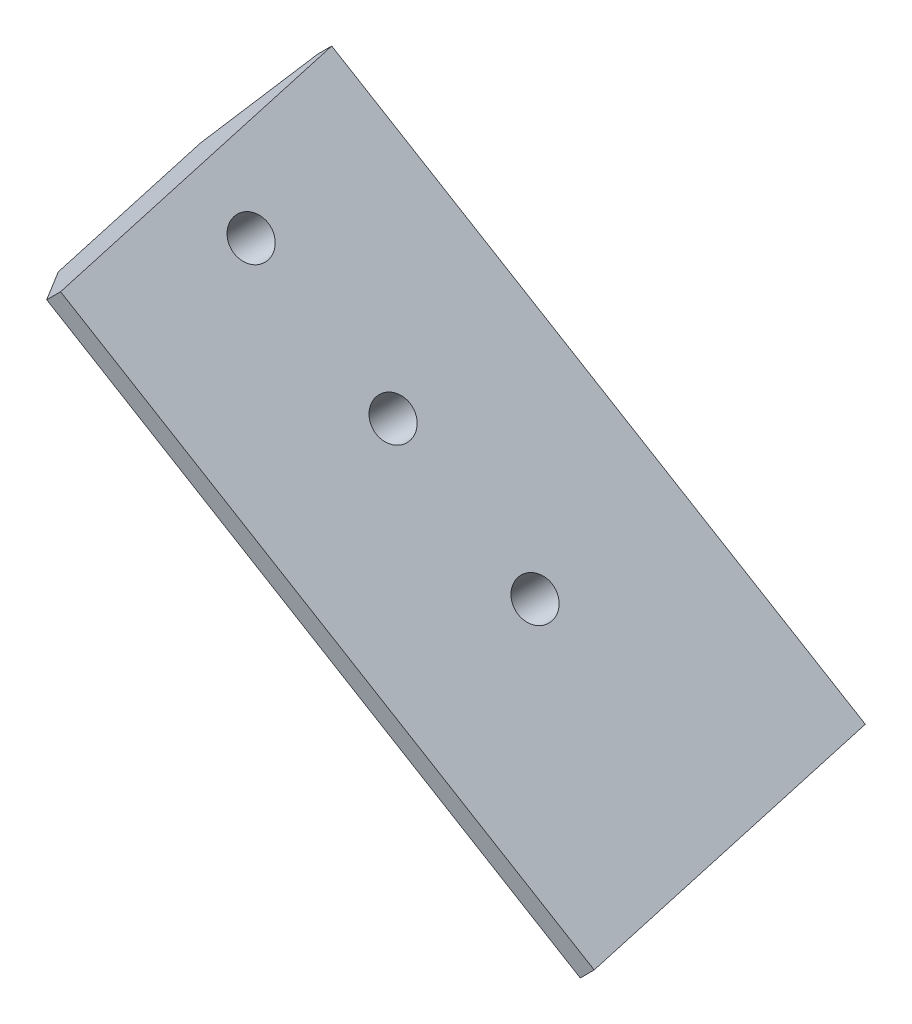
ISO-10303-21;
HEADER;
FILE_DESCRIPTION(('STEP AP214'),'2;1');
FILE_NAME('part.step','',(''),(''),'','','');
FILE_SCHEMA(('AUTOMOTIVE_DESIGN { 1 0 10303 214 1 1 1 1 }'));
ENDSEC;
DATA;
#1=APPLICATION_CONTEXT('core data for automotive mechanical design processes');
#2=APPLICATION_PROTOCOL_DEFINITION('international standard','automotive_design',2000,#1);
#3=PRODUCT_CONTEXT('',#1,'mechanical');
#4=PRODUCT('Part','Part','',(#3));
#5=PRODUCT_RELATED_PRODUCT_CATEGORY('part','',(#4));
#6=PRODUCT_DEFINITION_FORMATION('','',#4);
#7=PRODUCT_DEFINITION_CONTEXT('part definition',#1,'design');
#8=PRODUCT_DEFINITION('design','',#6,#7);
#9=PRODUCT_DEFINITION_SHAPE('','',#8);
#10=(LENGTH_UNIT() NAMED_UNIT(*) SI_UNIT(.MILLI.,.METRE.));
#11=(NAMED_UNIT(*) PLANE_ANGLE_UNIT() SI_UNIT($,.RADIAN.));
#12=(NAMED_UNIT(*) SI_UNIT($,.STERADIAN.) SOLID_ANGLE_UNIT());
#13=UNCERTAINTY_MEASURE_WITH_UNIT(LENGTH_MEASURE(1.E-05),#10,'distance_accuracy_value','');
#14=(GEOMETRIC_REPRESENTATION_CONTEXT(3) GLOBAL_UNCERTAINTY_ASSIGNED_CONTEXT((#13)) GLOBAL_UNIT_ASSIGNED_CONTEXT((#10,
#11,#12)) REPRESENTATION_CONTEXT('',''));
#15=CARTESIAN_POINT('',(0.,0.,0.));
#16=DIRECTION('',(0.,0.,1.));
#17=DIRECTION('',(1.,0.,0.));
#18=AXIS2_PLACEMENT_3D('',#15,#16,#17);
#19=CARTESIAN_POINT('',(2301.17091138971,-454.636764766131,75.5684436134808));
#20=DIRECTION('',(-0.707106781186548,-0.707106781186547,-1.38414541674983E-13));
#21=DIRECTION('',(0.707106781186547,-0.707106781186548,0.));
#22=AXIS2_PLACEMENT_3D('',#19,#20,#21);
#23=CONICAL_SURFACE('',#22,3.45000000012907,0.785398163395434);
#24=CARTESIAN_POINT('',(2301.17091138977,-454.636764766074,75.5684436134808));
#25=DIRECTION('',(-0.707106781186548,-0.707106781186547,-1.38414541674983E-13));
#26=DIRECTION('',(0.707106781186547,-0.707106781186548,0.));
#27=AXIS2_PLACEMENT_3D('',#24,#25,#26);
#28=CIRCLE('',#27,3.45000000004904);
#29=CARTESIAN_POINT('',(2303.6104297849,-457.076283161203,75.5684436134808));
#30=VERTEX_POINT('',#29);
#31=EDGE_CURVE('E122',#30,#30,#28,.F.);
#32=ORIENTED_EDGE('',*,*,#31,.F.);
#33=EDGE_LOOP('',(#32));
#34=FACE_BOUND('',#33,.T.);
#35=CARTESIAN_POINT('',(2301.84266283199,-453.965013323851,75.5684436134809));
#36=DIRECTION('',(-0.707106781186503,-0.707106781186592,0.));
#37=DIRECTION('',(0.707106781186592,-0.707106781186503,0.));
#38=AXIS2_PLACEMENT_3D('',#35,#36,#37);
#39=CIRCLE('',#38,2.5);
#40=CARTESIAN_POINT('',(2303.61042978496,-455.732780276817,75.5684436134809));
#41=VERTEX_POINT('',#40);
#42=EDGE_CURVE('E101',#41,#41,#39,.F.);
#43=ORIENTED_EDGE('',*,*,#42,.T.);
#44=EDGE_LOOP('',(#43));
#45=FACE_BOUND('',#44,.T.);
#46=ADVANCED_FACE('F17',(#34,#45),#23,.F.);
#47=CARTESIAN_POINT('',(2330.07002735808,-483.535880734265,68.36204424156));
#48=DIRECTION('',(-0.707106781186434,-0.707106781186661,0.));
#49=DIRECTION('',(0.707106781186661,-0.707106781186434,0.));
#50=AXIS2_PLACEMENT_3D('',#47,#48,#49);
#51=CONICAL_SURFACE('',#50,3.45000000007031,0.785398163408309);
#52=CARTESIAN_POINT('',(2330.07002735816,-483.535880734184,68.36204424156));
#53=DIRECTION('',(-0.707106781186434,-0.707106781186661,0.));
#54=DIRECTION('',(0.707106781186661,-0.707106781186434,0.));
#55=AXIS2_PLACEMENT_3D('',#52,#53,#54);
#56=CIRCLE('',#55,3.44999999995523);
#57=CARTESIAN_POINT('',(2332.50954575322,-485.975399129245,68.36204424156));
#58=VERTEX_POINT('',#57);
#59=EDGE_CURVE('E20',#58,#58,#56,.F.);
#60=ORIENTED_EDGE('',*,*,#59,.F.);
#61=EDGE_LOOP('',(#60));
#62=FACE_BOUND('',#61,.T.);
#63=CARTESIAN_POINT('',(2330.74177880024,-482.864129292097,68.3620442415602));
#64=DIRECTION('',(-0.707106781186503,-0.707106781186592,0.));
#65=DIRECTION('',(0.707106781186592,-0.707106781186503,0.));
#66=AXIS2_PLACEMENT_3D('',#63,#64,#65);
#67=CIRCLE('',#66,2.5);
#68=CARTESIAN_POINT('',(2332.50954575321,-484.631896245063,68.3620442415602));
#69=VERTEX_POINT('',#68);
#70=EDGE_CURVE('E106',#69,#69,#67,.F.);
#71=ORIENTED_EDGE('',*,*,#70,.T.);
#72=EDGE_LOOP('',(#71));
#73=FACE_BOUND('',#72,.T.);
#74=ADVANCED_FACE('F131',(#62,#73),#51,.F.);
#75=CARTESIAN_POINT('',(2315.62046937664,-469.086322752486,71.965243926872));
#76=DIRECTION('',(-0.707106781186513,-0.707106781186582,0.));
#77=DIRECTION('',(0.707106781186582,-0.707106781186513,0.));
#78=AXIS2_PLACEMENT_3D('',#75,#76,#77);
#79=CONICAL_SURFACE('',#78,3.44999999985659,0.785398163417411);
#80=CARTESIAN_POINT('',(2315.62046937657,-469.086322752556,71.965243926872));
#81=DIRECTION('',(-0.707106781186513,-0.707106781186582,0.));
#82=DIRECTION('',(0.707106781186582,-0.707106781186513,0.));
#83=AXIS2_PLACEMENT_3D('',#80,#81,#82);
#84=CIRCLE('',#83,3.44999999995523);
#85=CARTESIAN_POINT('',(2318.05998777163,-471.525841147618,71.965243926872));
#86=VERTEX_POINT('',#85);
#87=EDGE_CURVE('E103',#86,#86,#84,.F.);
#88=ORIENTED_EDGE('',*,*,#87,.F.);
#89=EDGE_LOOP('',(#88));
#90=FACE_BOUND('',#89,.T.);
#91=CARTESIAN_POINT('',(2316.29222081863,-468.41457131049,71.9652439268721));
#92=DIRECTION('',(-0.707106781186503,-0.707106781186592,0.));
#93=DIRECTION('',(0.707106781186592,-0.707106781186503,0.));
#94=AXIS2_PLACEMENT_3D('',#91,#92,#93);
#95=CIRCLE('',#94,2.5);
#96=CARTESIAN_POINT('',(2318.0599877716,-470.182338263456,71.9652439268721));
#97=VERTEX_POINT('',#96);
#98=EDGE_CURVE('E81',#97,#97,#95,.F.);
#99=ORIENTED_EDGE('',*,*,#98,.T.);
#100=EDGE_LOOP('',(#99));
#101=FACE_BOUND('',#100,.T.);
#102=ADVANCED_FACE('F134',(#90,#101),#79,.F.);
#103=CARTESIAN_POINT('',(2326.32812028619,-466.358944819765,50.6991222747484));
#104=DIRECTION('',(-0.586824088833399,-0.41317591116653,-0.696364240320077));
#105=DIRECTION('',(-0.764688187763723,0.,0.644400477571698));
#106=AXIS2_PLACEMENT_3D('',#103,#104,#105);
#107=PLANE('',#106);
#108=DIRECTION('',(0.696364240320073,-0.696364240319967,-0.173648177666922));
#109=VECTOR('',#108,1.);
#110=CARTESIAN_POINT('',(2294.31524887046,-447.781102246584,66.6534266797069));
#111=LINE('',#110,#109);
#112=CARTESIAN_POINT('',(2294.31524887046,-447.781102246584,66.6534266797069));
#113=VERTEX_POINT('',#112);
#114=CARTESIAN_POINT('',(2348.63165961543,-502.097512991543,53.1088688216854));
#115=VERTEX_POINT('',#114);
#116=EDGE_CURVE('E68',#113,#115,#111,.T.);
#117=ORIENTED_EDGE('',*,*,#116,.F.);
#118=DIRECTION('',(-0.413175911166596,-0.586824088833598,0.69636424031987));
#119=VECTOR('',#118,1.);
#120=CARTESIAN_POINT('',(2299.86627915403,-439.897103687606,57.2977530260918));
#121=LINE('',#120,#119);
#122=CARTESIAN_POINT('',(2299.86627915403,-439.897103687606,57.2977530260917));
#123=VERTEX_POINT('',#122);
#124=EDGE_CURVE('E84',#123,#113,#121,.T.);
#125=ORIENTED_EDGE('',*,*,#124,.F.);
#126=DIRECTION('',(-0.6963642403201,0.696364240319938,0.173648177666931));
#127=VECTOR('',#126,1.);
#128=CARTESIAN_POINT('',(2354.182689899,-494.213514432563,43.7531951680708));
#129=LINE('',#128,#127);
#130=CARTESIAN_POINT('',(2354.182689899,-494.213514432563,43.7531951680701));
#131=VERTEX_POINT('',#130);
#132=EDGE_CURVE('E73',#131,#123,#129,.T.);
#133=ORIENTED_EDGE('',*,*,#132,.F.);
#134=DIRECTION('',(-0.413175911166616,-0.586824088833581,0.696364240319873));
#135=VECTOR('',#134,1.);
#136=CARTESIAN_POINT('',(2354.182689899,-494.213514432563,43.7531951680711));
#137=LINE('',#136,#135);
#138=EDGE_CURVE('E295',#131,#115,#137,.T.);
#139=ORIENTED_EDGE('',*,*,#138,.T.);
#140=EDGE_LOOP('',(#117,#125,#133,#139));
#141=FACE_BOUND('',#140,.T.);
#142=ADVANCED_FACE('F85',(#141),#107,.T.);
#143=CARTESIAN_POINT('',(2323.35563388597,-476.821487262092,80.7357587416199));
#144=DIRECTION('',(-0.707106781186503,-0.707106781186592,0.));
#145=DIRECTION('',(0.707106781186592,-0.707106781186503,0.));
#146=AXIS2_PLACEMENT_3D('',#143,#144,#145);
#147=PLANE('',#146);
#148=ORIENTED_EDGE('',*,*,#116,.T.);
#149=DIRECTION('',(0.122787803968983,-0.122787803968964,0.984807753012208));
#150=VECTOR('',#149,1.);
#151=CARTESIAN_POINT('',(2349.92093155711,-503.386784933217,63.4493502283161));
#152=LINE('',#151,#150);
#153=CARTESIAN_POINT('',(2351.21020349878,-504.676056874893,73.7898316349431));
#154=VERTEX_POINT('',#153);
#155=EDGE_CURVE('E293',#115,#154,#152,.T.);
#156=ORIENTED_EDGE('',*,*,#155,.T.);
#157=DIRECTION('',(0.696364240320092,-0.696364240319951,-0.173648177666907));
#158=VECTOR('',#157,1.);
#159=CARTESIAN_POINT('',(2296.89379275381,-450.359646129935,87.3343894929638));
#160=LINE('',#159,#158);
#161=CARTESIAN_POINT('',(2296.89379275381,-450.359646129935,87.3343894929635));
#162=VERTEX_POINT('',#161);
#163=EDGE_CURVE('E98',#162,#154,#160,.T.);
#164=ORIENTED_EDGE('',*,*,#163,.F.);
#165=DIRECTION('',(0.122787803968983,-0.122787803968964,0.984807753012208));
#166=VECTOR('',#165,1.);
#167=CARTESIAN_POINT('',(2295.60452081214,-449.07037418826,76.9939080863367));
#168=LINE('',#167,#166);
#169=EDGE_CURVE('E88',#113,#162,#168,.T.);
#170=ORIENTED_EDGE('',*,*,#169,.F.);
#171=EDGE_LOOP('',(#148,#156,#164,#170));
#172=FACE_BOUND('',#171,.T.);
#173=ORIENTED_EDGE('',*,*,#87,.T.);
#174=EDGE_LOOP('',(#173));
#175=FACE_BOUND('',#174,.T.);
#176=ORIENTED_EDGE('',*,*,#31,.T.);
#177=EDGE_LOOP('',(#176));
#178=FACE_BOUND('',#177,.T.);
#179=ORIENTED_EDGE('',*,*,#59,.T.);
#180=EDGE_LOOP('',(#179));
#181=FACE_BOUND('',#180,.T.);
#182=ADVANCED_FACE('F129',(#172,#175,#178,#181),#147,.T.);
#183=CARTESIAN_POINT('',(2323.35563388597,-476.821487262092,80.7357587416199));
#184=DIRECTION('',(-0.413175911166535,-0.586824088833529,0.696364240319965));
#185=DIRECTION('',(0.,-0.764688187763602,-0.644400477571842));
#186=AXIS2_PLACEMENT_3D('',#183,#184,#185);
#187=PLANE('',#186);
#188=DIRECTION('',(0.696364240320033,-0.696364240320004,-0.173648177666931));
#189=VECTOR('',#188,1.);
#190=CARTESIAN_POINT('',(2304.77779131279,-444.808615846367,96.6900631465797));
#191=LINE('',#190,#189);
#192=CARTESIAN_POINT('',(2304.77779131279,-444.808615846367,96.6900631465809));
#193=VERTEX_POINT('',#192);
#194=CARTESIAN_POINT('',(2359.09420205775,-499.125026591325,83.1455052885593));
#195=VERTEX_POINT('',#194);
#196=EDGE_CURVE('E306',#193,#195,#191,.T.);
#197=ORIENTED_EDGE('',*,*,#196,.F.);
#198=DIRECTION('',(0.586824088833433,0.413175911166614,0.696364240319999));
#199=VECTOR('',#198,1.);
#200=CARTESIAN_POINT('',(2296.89379275381,-450.359646129934,87.3343894929633));
#201=LINE('',#200,#199);
#202=EDGE_CURVE('E308',#162,#193,#201,.T.);
#203=ORIENTED_EDGE('',*,*,#202,.F.);
#204=ORIENTED_EDGE('',*,*,#163,.T.);
#205=DIRECTION('',(0.586824088833312,0.413175911166412,0.696364240320221));
#206=VECTOR('',#205,1.);
#207=CARTESIAN_POINT('',(2351.21020349878,-504.676056874891,73.7898316349427));
#208=LINE('',#207,#206);
#209=EDGE_CURVE('E296',#154,#195,#208,.T.);
#210=ORIENTED_EDGE('',*,*,#209,.T.);
#211=EDGE_LOOP('',(#197,#203,#204,#210));
#212=FACE_BOUND('',#211,.T.);
#213=ADVANCED_FACE('F150',(#212),#187,.T.);
#214=CARTESIAN_POINT('',(2301.17091138986,-454.636764765981,75.5684436134808));
#215=DIRECTION('',(-0.707106781186503,-0.707106781186592,0.));
#216=DIRECTION('',(0.707106781186592,-0.707106781186503,0.));
#217=AXIS2_PLACEMENT_3D('',#214,#215,#216);
#218=CYLINDRICAL_SURFACE('',#217,2.5);
#219=CARTESIAN_POINT('',(2309.6561927641,-446.151483391741,75.5684436134817));
#220=DIRECTION('',(-0.707106781186503,-0.707106781186592,0.));
#221=DIRECTION('',(0.707106781186592,-0.707106781186503,0.));
#222=AXIS2_PLACEMENT_3D('',#219,#220,#221);
#223=CIRCLE('',#222,2.5);
#224=CARTESIAN_POINT('',(2311.42395971707,-447.919250344707,75.5684436134817));
#225=VERTEX_POINT('',#224);
#226=EDGE_CURVE('E118',#225,#225,#223,.T.);
#227=ORIENTED_EDGE('',*,*,#226,.F.);
#228=EDGE_LOOP('',(#227));
#229=FACE_BOUND('',#228,.T.);
#230=ORIENTED_EDGE('',*,*,#42,.F.);
#231=EDGE_LOOP('',(#230));
#232=FACE_BOUND('',#231,.T.);
#233=ADVANCED_FACE('F140',(#229,#232),#218,.F.);
#234=CARTESIAN_POINT('',(2330.07002735811,-483.535880734226,68.3620442415601));
#235=DIRECTION('',(-0.707106781186503,-0.707106781186592,0.));
#236=DIRECTION('',(0.707106781186592,-0.707106781186503,0.));
#237=AXIS2_PLACEMENT_3D('',#234,#235,#236);
#238=CYLINDRICAL_SURFACE('',#237,2.5);
#239=CARTESIAN_POINT('',(2338.55530873235,-475.050599359986,68.362044241561));
#240=DIRECTION('',(-0.707106781186503,-0.707106781186592,0.));
#241=DIRECTION('',(0.707106781186592,-0.707106781186503,0.));
#242=AXIS2_PLACEMENT_3D('',#239,#240,#241);
#243=CIRCLE('',#242,2.5);
#244=CARTESIAN_POINT('',(2340.32307568532,-476.818366312952,68.362044241561));
#245=VERTEX_POINT('',#244);
#246=EDGE_CURVE('E115',#245,#245,#243,.T.);
#247=ORIENTED_EDGE('',*,*,#246,.F.);
#248=EDGE_LOOP('',(#247));
#249=FACE_BOUND('',#248,.T.);
#250=ORIENTED_EDGE('',*,*,#70,.F.);
#251=EDGE_LOOP('',(#250));
#252=FACE_BOUND('',#251,.T.);
#253=ADVANCED_FACE('F137',(#249,#252),#238,.F.);
#254=CARTESIAN_POINT('',(2315.6204693765,-469.08632275262,71.965243926872));
#255=DIRECTION('',(-0.707106781186503,-0.707106781186592,0.));
#256=DIRECTION('',(0.707106781186592,-0.707106781186503,0.));
#257=AXIS2_PLACEMENT_3D('',#254,#255,#256);
#258=CYLINDRICAL_SURFACE('',#257,2.5);
#259=ORIENTED_EDGE('',*,*,#98,.F.);
#260=EDGE_LOOP('',(#259));
#261=FACE_BOUND('',#260,.T.);
#262=CARTESIAN_POINT('',(2324.10575075074,-460.60104137838,71.9652439268729));
#263=DIRECTION('',(-0.707106781186503,-0.707106781186592,0.));
#264=DIRECTION('',(0.707106781186592,-0.707106781186503,0.));
#265=AXIS2_PLACEMENT_3D('',#262,#263,#264);
#266=CIRCLE('',#265,2.5);
#267=CARTESIAN_POINT('',(2325.87351770371,-462.368808331346,71.9652439268729));
#268=VERTEX_POINT('',#267);
#269=EDGE_CURVE('E111',#268,#268,#266,.T.);
#270=ORIENTED_EDGE('',*,*,#269,.F.);
#271=EDGE_LOOP('',(#270));
#272=FACE_BOUND('',#271,.T.);
#273=ADVANCED_FACE('F139',(#261,#272),#258,.F.);
#274=CARTESIAN_POINT('',(2328.09588723916,-464.591177866798,50.6991222747486));
#275=DIRECTION('',(-0.122787803968928,0.122787803969019,-0.984807753012208));
#276=DIRECTION('',(0.,0.992316665359125,0.12372403020653));
#277=AXIS2_PLACEMENT_3D('',#274,#275,#276);
#278=PLANE('',#277);
#279=ORIENTED_EDGE('',*,*,#132,.T.);
#280=DIRECTION('',(-0.707106781186494,-0.707106781186601,0.));
#281=VECTOR('',#280,1.);
#282=CARTESIAN_POINT('',(2306.5837935753,-433.179589266335,57.2977530260925));
#283=LINE('',#282,#281);
#284=CARTESIAN_POINT('',(2301.634046107,-438.129336734641,57.2977530260919));
#285=VERTEX_POINT('',#284);
#286=EDGE_CURVE('E76',#285,#123,#283,.T.);
#287=ORIENTED_EDGE('',*,*,#286,.F.);
#288=DIRECTION('',(-0.696364240320071,0.696364240319964,0.17364817766694));
#289=VECTOR('',#288,1.);
#290=CARTESIAN_POINT('',(2355.95045685196,-492.445747479596,43.7531951680713));
#291=LINE('',#290,#289);
#292=CARTESIAN_POINT('',(2355.95045685196,-492.445747479598,43.7531951680713));
#293=VERTEX_POINT('',#292);
#294=EDGE_CURVE('E114',#293,#285,#291,.T.);
#295=ORIENTED_EDGE('',*,*,#294,.F.);
#296=DIRECTION('',(-0.707106781186494,-0.707106781186601,0.));
#297=VECTOR('',#296,1.);
#298=CARTESIAN_POINT('',(2360.90020432027,-487.496000011292,43.7531951680707));
#299=LINE('',#298,#297);
#300=EDGE_CURVE('E79',#293,#131,#299,.T.);
#301=ORIENTED_EDGE('',*,*,#300,.T.);
#302=EDGE_LOOP('',(#279,#287,#295,#301));
#303=FACE_BOUND('',#302,.T.);
#304=ADVANCED_FACE('F74',(#303),#278,.T.);
#305=CARTESIAN_POINT('',(2309.03954965468,-435.635345345714,76.9939080863367));
#306=DIRECTION('',(-0.696364240320072,0.696364240319966,0.173648177666931));
#307=DIRECTION('',(-0.707106781186494,-0.707106781186601,0.));
#308=AXIS2_PLACEMENT_3D('',#305,#306,#307);
#309=PLANE('',#308);
#310=ORIENTED_EDGE('',*,*,#202,.T.);
#311=DIRECTION('',(-0.70710678118506,-0.707106781188035,-4.38538094727734E-13));
#312=VECTOR('',#311,1.);
#313=CARTESIAN_POINT('',(2306.54555826575,-443.0408488934,96.6900631465808));
#314=LINE('',#313,#312);
#315=CARTESIAN_POINT('',(2306.54555826575,-443.0408488934,96.6900631465805));
#316=VERTEX_POINT('',#315);
#317=EDGE_CURVE('E303',#316,#193,#314,.T.);
#318=ORIENTED_EDGE('',*,*,#317,.F.);
#319=DIRECTION('',(0.12278780396883,-0.122787803968923,0.984807753012232));
#320=VECTOR('',#319,1.);
#321=CARTESIAN_POINT('',(2301.634046107,-438.129336734641,57.297753026092));
#322=LINE('',#321,#320);
#323=EDGE_CURVE('E93',#285,#316,#322,.T.);
#324=ORIENTED_EDGE('',*,*,#323,.F.);
#325=ORIENTED_EDGE('',*,*,#286,.T.);
#326=ORIENTED_EDGE('',*,*,#124,.T.);
#327=ORIENTED_EDGE('',*,*,#169,.T.);
#328=EDGE_LOOP('',(#310,#318,#324,#325,#326,#327));
#329=FACE_BOUND('',#328,.T.);
#330=ADVANCED_FACE('F91',(#329),#309,.T.);
#331=CARTESIAN_POINT('',(2331.23963244495,-471.270456978526,90.0914323952366));
#332=DIRECTION('',(0.122787803968928,-0.122787803969019,0.984807753012208));
#333=DIRECTION('',(0.,-0.992316665359125,-0.12372403020653));
#334=AXIS2_PLACEMENT_3D('',#331,#332,#333);
#335=PLANE('',#334);
#336=DIRECTION('',(0.696364240320073,-0.696364240319966,-0.173648177666924));
#337=VECTOR('',#336,1.);
#338=CARTESIAN_POINT('',(2306.54555826575,-443.040848893398,96.6900631465802));
#339=LINE('',#338,#337);
#340=CARTESIAN_POINT('',(2360.86196901072,-497.357259638358,83.1455052885592));
#341=VERTEX_POINT('',#340);
#342=EDGE_CURVE('E26',#316,#341,#339,.T.);
#343=ORIENTED_EDGE('',*,*,#342,.F.);
#344=ORIENTED_EDGE('',*,*,#317,.T.);
#345=ORIENTED_EDGE('',*,*,#196,.T.);
#346=DIRECTION('',(-0.707106781186494,-0.707106781186601,0.));
#347=VECTOR('',#346,1.);
#348=CARTESIAN_POINT('',(2365.81171647903,-492.40751217005,83.1455052885585));
#349=LINE('',#348,#347);
#350=EDGE_CURVE('E35',#195,#341,#349,.F.);
#351=ORIENTED_EDGE('',*,*,#350,.T.);
#352=EDGE_LOOP('',(#343,#344,#345,#351));
#353=FACE_BOUND('',#352,.T.);
#354=ADVANCED_FACE('F162',(#353),#335,.T.);
#355=CARTESIAN_POINT('',(2363.35596039965,-489.951756090671,63.4493502283161));
#356=DIRECTION('',(-0.696364240320072,0.696364240319966,0.173648177666931));
#357=DIRECTION('',(-0.707106781186494,-0.707106781186601,0.));
#358=AXIS2_PLACEMENT_3D('',#355,#356,#357);
#359=PLANE('',#358);
#360=ORIENTED_EDGE('',*,*,#209,.F.);
#361=ORIENTED_EDGE('',*,*,#155,.F.);
#362=ORIENTED_EDGE('',*,*,#138,.F.);
#363=ORIENTED_EDGE('',*,*,#300,.F.);
#364=DIRECTION('',(-0.122787803968959,0.122787803969052,-0.9848077530122));
#365=VECTOR('',#364,1.);
#366=CARTESIAN_POINT('',(2360.86196901072,-497.357259638358,83.1455052885595));
#367=LINE('',#366,#365);
#368=EDGE_CURVE('E11',#341,#293,#367,.T.);
#369=ORIENTED_EDGE('',*,*,#368,.F.);
#370=ORIENTED_EDGE('',*,*,#350,.F.);
#371=EDGE_LOOP('',(#360,#361,#362,#363,#369,#370));
#372=FACE_BOUND('',#371,.T.);
#373=ADVANCED_FACE('F156',(#372),#359,.F.);
#374=CARTESIAN_POINT('',(2328.09588723916,-464.591177866798,50.6991222747486));
#375=DIRECTION('',(0.707106781186503,0.707106781186592,0.));
#376=DIRECTION('',(-0.707106781186592,0.707106781186503,0.));
#377=AXIS2_PLACEMENT_3D('',#374,#375,#376);
#378=PLANE('',#377);
#379=ORIENTED_EDGE('',*,*,#342,.T.);
#380=ORIENTED_EDGE('',*,*,#368,.T.);
#381=ORIENTED_EDGE('',*,*,#294,.T.);
#382=ORIENTED_EDGE('',*,*,#323,.T.);
#383=EDGE_LOOP('',(#379,#380,#381,#382));
#384=FACE_BOUND('',#383,.T.);
#385=ORIENTED_EDGE('',*,*,#269,.T.);
#386=EDGE_LOOP('',(#385));
#387=FACE_BOUND('',#386,.T.);
#388=ORIENTED_EDGE('',*,*,#246,.T.);
#389=EDGE_LOOP('',(#388));
#390=FACE_BOUND('',#389,.T.);
#391=ORIENTED_EDGE('',*,*,#226,.T.);
#392=EDGE_LOOP('',(#391));
#393=FACE_BOUND('',#392,.T.);
#394=ADVANCED_FACE('F154',(#384,#387,#390,#393),#378,.T.);
#395=CLOSED_SHELL('',(#46,#74,#102,#142,#182,#213,#233,#253,#273,#304,#330,#354,#373,#394));
#396=MANIFOLD_SOLID_BREP('B1',#395);
#397=ADVANCED_BREP_SHAPE_REPRESENTATION('',(#18,#396),#14);
#398=SHAPE_DEFINITION_REPRESENTATION(#9,#397);
ENDSEC;
END-ISO-10303-21;
